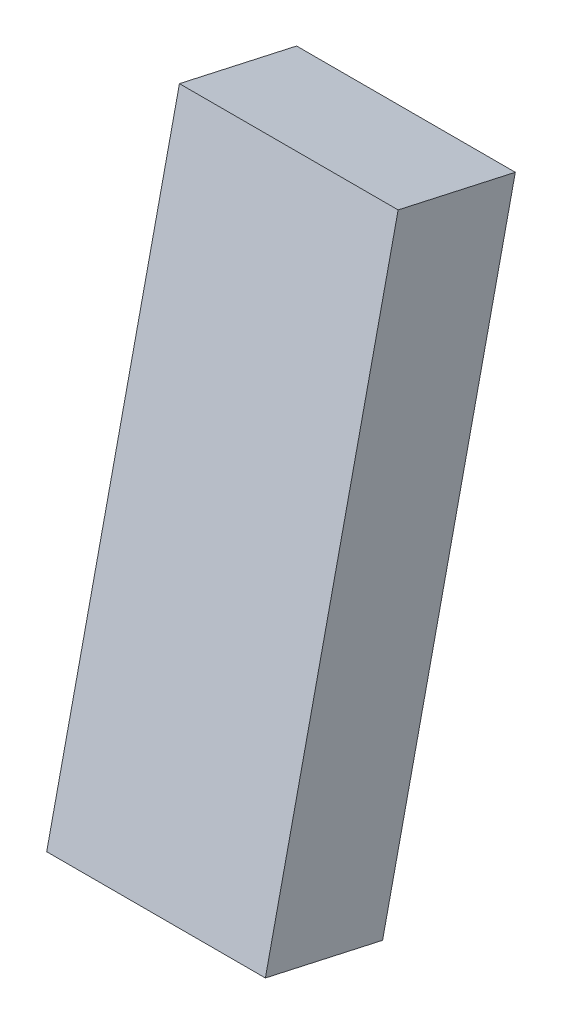
ISO-10303-21;
HEADER;
FILE_DESCRIPTION(('STEP AP214'),'2;1');
FILE_NAME('part.step','',(''),(''),'','','');
FILE_SCHEMA(('AUTOMOTIVE_DESIGN { 1 0 10303 214 1 1 1 1 }'));
ENDSEC;
DATA;
#1=APPLICATION_CONTEXT('core data for automotive mechanical design processes');
#2=APPLICATION_PROTOCOL_DEFINITION('international standard','automotive_design',2000,#1);
#3=PRODUCT_CONTEXT('',#1,'mechanical');
#4=PRODUCT('Part','Part','',(#3));
#5=PRODUCT_RELATED_PRODUCT_CATEGORY('part','',(#4));
#6=PRODUCT_DEFINITION_FORMATION('','',#4);
#7=PRODUCT_DEFINITION_CONTEXT('part definition',#1,'design');
#8=PRODUCT_DEFINITION('design','',#6,#7);
#9=PRODUCT_DEFINITION_SHAPE('','',#8);
#10=(LENGTH_UNIT() NAMED_UNIT(*) SI_UNIT(.MILLI.,.METRE.));
#11=(NAMED_UNIT(*) PLANE_ANGLE_UNIT() SI_UNIT($,.RADIAN.));
#12=(NAMED_UNIT(*) SI_UNIT($,.STERADIAN.) SOLID_ANGLE_UNIT());
#13=UNCERTAINTY_MEASURE_WITH_UNIT(LENGTH_MEASURE(1.E-05),#10,'distance_accuracy_value','');
#14=(GEOMETRIC_REPRESENTATION_CONTEXT(3) GLOBAL_UNCERTAINTY_ASSIGNED_CONTEXT((#13)) GLOBAL_UNIT_ASSIGNED_CONTEXT((#10,
#11,#12)) REPRESENTATION_CONTEXT('',''));
#15=CARTESIAN_POINT('',(0.,0.,0.));
#16=DIRECTION('',(0.,0.,1.));
#17=DIRECTION('',(1.,0.,0.));
#18=AXIS2_PLACEMENT_3D('',#15,#16,#17);
#19=CARTESIAN_POINT('',(90.75,7.26219416581,-2.040454752565));
#20=DIRECTION('',(0.,0.216439613938107,0.976296007119932));
#21=DIRECTION('',(1.,0.,0.));
#22=AXIS2_PLACEMENT_3D('',#19,#20,#21);
#23=PLANE('',#22);
#24=CARTESIAN_POINT('',(99.55,-17.1884939349768,3.17527639446329));
#25=DIRECTION('',(-1.,0.,0.));
#26=VECTOR('',#25,1.);
#27=LINE('',#24,#26);
#28=CARTESIAN_POINT('',(99.6166666666661,-17.04389182643,3.2115041797466));
#29=VERTEX_POINT('',#28);
#30=CARTESIAN_POINT('',(81.8833333333338,-17.0438918264295,3.2115041797463));
#31=VERTEX_POINT('',#30);
#32=EDGE_CURVE('E75',#29,#31,#27,.T.);
#33=ORIENTED_EDGE('',*,*,#32,.F.);
#34=CARTESIAN_POINT('',(99.75,31.4310472195999,-7.60341637965439));
#35=DIRECTION('',(0.,-0.976296007119932,0.216439613938107));
#36=VECTOR('',#35,1.);
#37=LINE('',#34,#36);
#38=CARTESIAN_POINT('',(99.6166666666658,31.5105629276686,-7.55275928677484));
#39=VERTEX_POINT('',#38);
#40=EDGE_CURVE('E58',#39,#29,#37,.T.);
#41=ORIENTED_EDGE('',*,*,#40,.F.);
#42=CARTESIAN_POINT('',(81.95,31.6263064210241,-7.6467043024419));
#43=DIRECTION('',(1.,0.,0.));
#44=VECTOR('',#43,1.);
#45=LINE('',#42,#44);
#46=CARTESIAN_POINT('',(81.883333333334,31.5105629276682,-7.55275928677487));
#47=VERTEX_POINT('',#46);
#48=EDGE_CURVE('E71',#47,#39,#45,.T.);
#49=ORIENTED_EDGE('',*,*,#48,.F.);
#50=CARTESIAN_POINT('',(81.75,-16.9932347335499,3.1319884716764));
#51=DIRECTION('',(0.,0.976296007119932,-0.216439613938107));
#52=VECTOR('',#51,1.);
#53=LINE('',#50,#52);
#54=EDGE_CURVE('E78',#31,#47,#53,.T.);
#55=ORIENTED_EDGE('',*,*,#54,.F.);
#56=EDGE_LOOP('',(#33,#41,#49,#55));
#57=FACE_BOUND('',#56,.T.);
#58=ADVANCED_FACE('F17',(#57),#23,.T.);
#59=CARTESIAN_POINT('',(99.75,-19.30960215157,-6.392424475311));
#60=DIRECTION('',(1.,0.,0.));
#61=DIRECTION('',(0.,1.,0.));
#62=AXIS2_PLACEMENT_3D('',#59,#60,#61);
#63=PLANE('',#62);
#64=CARTESIAN_POINT('',(99.55,-19.2663142287823,-6.1971652738865));
#65=DIRECTION('',(0.,0.216439613938107,0.976296007119932));
#66=VECTOR('',#65,1.);
#67=LINE('',#64,#66);
#68=CARTESIAN_POINT('',(99.616666666667,-19.1505707354307,-6.29111028955197));
#69=VERTEX_POINT('',#68);
#70=EDGE_CURVE('E63',#69,#29,#67,.T.);
#71=ORIENTED_EDGE('',*,*,#70,.F.);
#72=CARTESIAN_POINT('',(99.75,-19.071055027361,-6.24045319667937));
#73=DIRECTION('',(0.,0.976296007119932,-0.216439613938107));
#74=VECTOR('',#73,1.);
#75=LINE('',#72,#74);
#76=CARTESIAN_POINT('',(99.6166666666658,29.4038840186718,-17.0553737560754));
#77=VERTEX_POINT('',#76);
#78=EDGE_CURVE('E251',#69,#77,#75,.T.);
#79=ORIENTED_EDGE('',*,*,#78,.T.);
#80=CARTESIAN_POINT('',(99.55,31.6263064210241,-7.6467043024419));
#81=DIRECTION('',(0.,-0.216439613938107,-0.976296007119932));
#82=VECTOR('',#81,1.);
#83=LINE('',#80,#82);
#84=EDGE_CURVE('E66',#39,#77,#83,.T.);
#85=ORIENTED_EDGE('',*,*,#84,.F.);
#86=ORIENTED_EDGE('',*,*,#40,.T.);
#87=EDGE_LOOP('',(#71,#79,#85,#86));
#88=FACE_BOUND('',#87,.T.);
#89=ADVANCED_FACE('F61',(#88),#63,.T.);
#90=CARTESIAN_POINT('',(99.75,29.50519820443,-17.21440517222));
#91=DIRECTION('',(0.,0.976296007119932,-0.216439613938107));
#92=DIRECTION('',(-1.,0.,0.));
#93=AXIS2_PLACEMENT_3D('',#90,#91,#92);
#94=PLANE('',#93);
#95=CARTESIAN_POINT('',(99.55,29.5484861272185,-17.0191459707919));
#96=DIRECTION('',(-1.,0.,0.));
#97=VECTOR('',#96,1.);
#98=LINE('',#95,#97);
#99=CARTESIAN_POINT('',(81.883333333334,29.4038840186713,-17.0553737560745));
#100=VERTEX_POINT('',#99);
#101=EDGE_CURVE('E217',#77,#100,#98,.T.);
#102=ORIENTED_EDGE('',*,*,#101,.T.);
#103=CARTESIAN_POINT('',(81.75,31.431047219597,-7.60341637965334));
#104=DIRECTION('',(0.,-0.216439613938107,-0.976296007119933));
#105=VECTOR('',#104,1.);
#106=LINE('',#103,#105);
#107=EDGE_CURVE('E92',#47,#100,#106,.T.);
#108=ORIENTED_EDGE('',*,*,#107,.F.);
#109=ORIENTED_EDGE('',*,*,#48,.T.);
#110=ORIENTED_EDGE('',*,*,#84,.T.);
#111=EDGE_LOOP('',(#102,#108,#109,#110));
#112=FACE_BOUND('',#111,.T.);
#113=ADVANCED_FACE('F177',(#112),#94,.T.);
#114=CARTESIAN_POINT('',(81.75,29.50519820443,-17.21440517222));
#115=DIRECTION('',(-1.,0.,0.));
#116=DIRECTION('',(0.,0.,1.));
#117=AXIS2_PLACEMENT_3D('',#114,#115,#116);
#118=PLANE('',#117);
#119=ORIENTED_EDGE('',*,*,#54,.T.);
#120=ORIENTED_EDGE('',*,*,#107,.T.);
#121=CARTESIAN_POINT('',(81.75,29.353226925791,-16.9758580480056));
#122=DIRECTION('',(0.,-0.976296007119932,0.216439613938107));
#123=VECTOR('',#122,1.);
#124=LINE('',#121,#123);
#125=CARTESIAN_POINT('',(81.8833333333328,-19.1505707354297,-6.29111028955131));
#126=VERTEX_POINT('',#125);
#127=EDGE_CURVE('E29',#100,#126,#124,.T.);
#128=ORIENTED_EDGE('',*,*,#127,.T.);
#129=CARTESIAN_POINT('',(81.95,-17.1884939349768,3.17527639446328));
#130=DIRECTION('',(0.,-0.216439613938107,-0.976296007119932));
#131=VECTOR('',#130,1.);
#132=LINE('',#129,#131);
#133=EDGE_CURVE('E83',#31,#126,#132,.T.);
#134=ORIENTED_EDGE('',*,*,#133,.F.);
#135=EDGE_LOOP('',(#119,#120,#128,#134));
#136=FACE_BOUND('',#135,.T.);
#137=ADVANCED_FACE('F111',(#136),#118,.T.);
#138=CARTESIAN_POINT('',(81.75,-19.30960215157,-6.392424475311));
#139=DIRECTION('',(0.,-0.976296007119932,0.216439613938107));
#140=DIRECTION('',(-1.,0.,0.));
#141=AXIS2_PLACEMENT_3D('',#138,#139,#140);
#142=PLANE('',#141);
#143=ORIENTED_EDGE('',*,*,#32,.T.);
#144=ORIENTED_EDGE('',*,*,#133,.T.);
#145=CARTESIAN_POINT('',(81.95,-19.2663142287823,-6.1971652738865));
#146=DIRECTION('',(1.,0.,0.));
#147=VECTOR('',#146,1.);
#148=LINE('',#145,#147);
#149=EDGE_CURVE('E11',#126,#69,#148,.T.);
#150=ORIENTED_EDGE('',*,*,#149,.T.);
#151=ORIENTED_EDGE('',*,*,#70,.T.);
#152=EDGE_LOOP('',(#143,#144,#150,#151));
#153=FACE_BOUND('',#152,.T.);
#154=ADVANCED_FACE('F87',(#153),#142,.T.);
#155=CARTESIAN_POINT('',(90.75,5.097798026429,-11.80341482376));
#156=DIRECTION('',(0.,0.216439613938107,0.976296007119932));
#157=DIRECTION('',(1.,0.,0.));
#158=AXIS2_PLACEMENT_3D('',#155,#156,#157);
#159=PLANE('',#158);
#160=ORIENTED_EDGE('',*,*,#127,.F.);
#161=ORIENTED_EDGE('',*,*,#101,.F.);
#162=ORIENTED_EDGE('',*,*,#78,.F.);
#163=ORIENTED_EDGE('',*,*,#149,.F.);
#164=EDGE_LOOP('',(#160,#161,#162,#163));
#165=FACE_BOUND('',#164,.T.);
#166=ADVANCED_FACE('F110',(#165),#159,.F.);
#167=CLOSED_SHELL('',(#58,#89,#113,#137,#154,#166));
#168=MANIFOLD_SOLID_BREP('B1',#167);
#169=ADVANCED_BREP_SHAPE_REPRESENTATION('',(#18,#168),#14);
#170=SHAPE_DEFINITION_REPRESENTATION(#9,#169);
ENDSEC;
END-ISO-10303-21;
